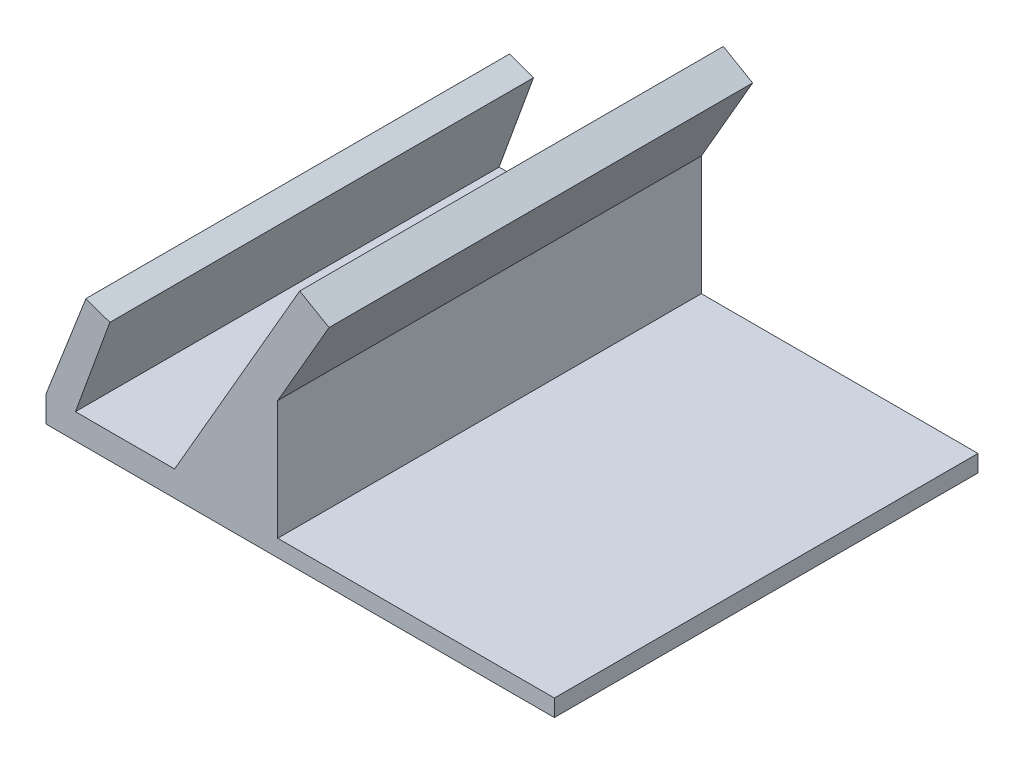
ISO-10303-21;
HEADER;
FILE_DESCRIPTION(('STEP AP214'),'2;1');
FILE_NAME('part.step','',(''),(''),'','','');
FILE_SCHEMA(('AUTOMOTIVE_DESIGN { 1 0 10303 214 1 1 1 1 }'));
ENDSEC;
DATA;
#1=APPLICATION_CONTEXT('core data for automotive mechanical design processes');
#2=APPLICATION_PROTOCOL_DEFINITION('international standard','automotive_design',2000,#1);
#3=PRODUCT_CONTEXT('',#1,'mechanical');
#4=PRODUCT('Part','Part','',(#3));
#5=PRODUCT_RELATED_PRODUCT_CATEGORY('part','',(#4));
#6=PRODUCT_DEFINITION_FORMATION('','',#4);
#7=PRODUCT_DEFINITION_CONTEXT('part definition',#1,'design');
#8=PRODUCT_DEFINITION('design','',#6,#7);
#9=PRODUCT_DEFINITION_SHAPE('','',#8);
#10=(LENGTH_UNIT() NAMED_UNIT(*) SI_UNIT(.MILLI.,.METRE.));
#11=(NAMED_UNIT(*) PLANE_ANGLE_UNIT() SI_UNIT($,.RADIAN.));
#12=(NAMED_UNIT(*) SI_UNIT($,.STERADIAN.) SOLID_ANGLE_UNIT());
#13=UNCERTAINTY_MEASURE_WITH_UNIT(LENGTH_MEASURE(1.E-05),#10,'distance_accuracy_value','');
#14=(GEOMETRIC_REPRESENTATION_CONTEXT(3) GLOBAL_UNCERTAINTY_ASSIGNED_CONTEXT((#13)) GLOBAL_UNIT_ASSIGNED_CONTEXT((#10,
#11,#12)) REPRESENTATION_CONTEXT('',''));
#15=CARTESIAN_POINT('',(0.,0.,0.));
#16=DIRECTION('',(0.,0.,1.));
#17=DIRECTION('',(1.,0.,0.));
#18=AXIS2_PLACEMENT_3D('',#15,#16,#17);
#19=CARTESIAN_POINT('',(-84.4925339039773,-6.99938021269525,50.));
#20=DIRECTION('',(0.,1.,0.));
#21=DIRECTION('',(0.,0.,1.));
#22=AXIS2_PLACEMENT_3D('',#19,#20,#21);
#23=PLANE('',#22);
#24=DIRECTION('',(1.,0.,0.));
#25=VECTOR('',#24,1.);
#26=CARTESIAN_POINT('',(-84.4925339039773,-6.99938021269525,0.));
#27=LINE('',#26,#25);
#28=CARTESIAN_POINT('',(-84.4925339039773,-6.99938021269525,0.));
#29=VERTEX_POINT('',#28);
#30=CARTESIAN_POINT('',(-24.4925339039772,-6.99938021269525,0.));
#31=VERTEX_POINT('',#30);
#32=EDGE_CURVE('E146',#29,#31,#27,.T.);
#33=ORIENTED_EDGE('',*,*,#32,.T.);
#34=DIRECTION('',(0.,0.,-1.));
#35=VECTOR('',#34,1.);
#36=CARTESIAN_POINT('',(-24.4925339039772,-6.99938021269525,50.));
#37=LINE('',#36,#35);
#38=CARTESIAN_POINT('',(-24.4925339039772,-6.99938021269525,50.));
#39=VERTEX_POINT('',#38);
#40=EDGE_CURVE('E228',#39,#31,#37,.T.);
#41=ORIENTED_EDGE('',*,*,#40,.F.);
#42=DIRECTION('',(1.,0.,0.));
#43=VECTOR('',#42,1.);
#44=CARTESIAN_POINT('',(-84.4925339039773,-6.99938021269525,50.));
#45=LINE('',#44,#43);
#46=CARTESIAN_POINT('',(-84.4925339039773,-6.99938021269525,50.));
#47=VERTEX_POINT('',#46);
#48=EDGE_CURVE('E98',#47,#39,#45,.T.);
#49=ORIENTED_EDGE('',*,*,#48,.F.);
#50=DIRECTION('',(0.,0.,-1.));
#51=VECTOR('',#50,1.);
#52=CARTESIAN_POINT('',(-84.4925339039773,-6.99938021269525,50.));
#53=LINE('',#52,#51);
#54=EDGE_CURVE('E11',#47,#29,#53,.T.);
#55=ORIENTED_EDGE('',*,*,#54,.T.);
#56=EDGE_LOOP('',(#33,#41,#49,#55));
#57=FACE_BOUND('',#56,.T.);
#58=ADVANCED_FACE('F33',(#57),#23,.F.);
#59=CARTESIAN_POINT('',(-45.4925339039751,-4.99938021269525,50.));
#60=DIRECTION('',(0.,-1.,0.));
#61=DIRECTION('',(1.,0.,0.));
#62=AXIS2_PLACEMENT_3D('',#59,#60,#61);
#63=PLANE('',#62);
#64=DIRECTION('',(-1.,0.,0.));
#65=VECTOR('',#64,1.);
#66=CARTESIAN_POINT('',(-45.4925339039751,-4.99938021269525,0.));
#67=LINE('',#66,#65);
#68=CARTESIAN_POINT('',(-24.4925339039772,-4.99938021269525,0.));
#69=VERTEX_POINT('',#68);
#70=CARTESIAN_POINT('',(-57.1473766382508,-4.99938021269525,0.));
#71=VERTEX_POINT('',#70);
#72=EDGE_CURVE('E149',#69,#71,#67,.T.);
#73=ORIENTED_EDGE('',*,*,#72,.T.);
#74=DIRECTION('',(0.,0.,-1.));
#75=VECTOR('',#74,1.);
#76=CARTESIAN_POINT('',(-57.1473766382508,-4.99938021269525,50.));
#77=LINE('',#76,#75);
#78=CARTESIAN_POINT('',(-57.1473766382508,-4.99938021269525,50.));
#79=VERTEX_POINT('',#78);
#80=EDGE_CURVE('E41',#79,#71,#77,.T.);
#81=ORIENTED_EDGE('',*,*,#80,.F.);
#82=DIRECTION('',(-1.,0.,0.));
#83=VECTOR('',#82,1.);
#84=CARTESIAN_POINT('',(-44.4925339039772,-4.99938021269525,50.));
#85=LINE('',#84,#83);
#86=CARTESIAN_POINT('',(-24.4925339039772,-4.99938021269525,50.));
#87=VERTEX_POINT('',#86);
#88=EDGE_CURVE('E220',#87,#79,#85,.T.);
#89=ORIENTED_EDGE('',*,*,#88,.F.);
#90=DIRECTION('',(0.,0.,1.));
#91=VECTOR('',#90,1.);
#92=CARTESIAN_POINT('',(-24.4925339039772,-4.99938021269525,50.));
#93=LINE('',#92,#91);
#94=EDGE_CURVE('E150',#69,#87,#93,.T.);
#95=ORIENTED_EDGE('',*,*,#94,.F.);
#96=EDGE_LOOP('',(#73,#81,#89,#95));
#97=FACE_BOUND('',#96,.T.);
#98=ADVANCED_FACE('F242',(#97),#63,.F.);
#99=CARTESIAN_POINT('',(-57.1473766382508,-4.99938021269525,50.));
#100=DIRECTION('',(-1.,0.,0.));
#101=DIRECTION('',(0.,-1.,0.));
#102=AXIS2_PLACEMENT_3D('',#99,#100,#101);
#103=PLANE('',#102);
#104=DIRECTION('',(0.,1.,0.));
#105=VECTOR('',#104,1.);
#106=CARTESIAN_POINT('',(-57.1473766382508,-4.99938021269525,0.));
#107=LINE('',#106,#105);
#108=CARTESIAN_POINT('',(-57.1473766382508,9.0724224478723,0.));
#109=VERTEX_POINT('',#108);
#110=EDGE_CURVE('E152',#71,#109,#107,.T.);
#111=ORIENTED_EDGE('',*,*,#110,.T.);
#112=DIRECTION('',(0.,0.,-1.));
#113=VECTOR('',#112,1.);
#114=CARTESIAN_POINT('',(-57.1473766382508,9.0724224478723,50.));
#115=LINE('',#114,#113);
#116=CARTESIAN_POINT('',(-57.1473766382508,9.0724224478723,50.));
#117=VERTEX_POINT('',#116);
#118=EDGE_CURVE('E183',#117,#109,#115,.T.);
#119=ORIENTED_EDGE('',*,*,#118,.F.);
#120=DIRECTION('',(0.,1.,0.));
#121=VECTOR('',#120,1.);
#122=CARTESIAN_POINT('',(-57.1473766382508,-4.99938021269525,50.));
#123=LINE('',#122,#121);
#124=EDGE_CURVE('E192',#79,#117,#123,.T.);
#125=ORIENTED_EDGE('',*,*,#124,.F.);
#126=ORIENTED_EDGE('',*,*,#80,.T.);
#127=EDGE_LOOP('',(#111,#119,#125,#126));
#128=FACE_BOUND('',#127,.T.);
#129=ADVANCED_FACE('F190',(#128),#103,.F.);
#130=CARTESIAN_POINT('',(-51.5857610761588,18.7054231735816,50.));
#131=DIRECTION('',(-0.866025403784443,0.499999999999992,0.));
#132=DIRECTION('',(-0.499999999999992,-0.866025403784443,0.));
#133=AXIS2_PLACEMENT_3D('',#130,#131,#132);
#134=PLANE('',#133);
#135=DIRECTION('',(0.499999999999992,0.866025403784443,0.));
#136=VECTOR('',#135,1.);
#137=CARTESIAN_POINT('',(-51.5857610761588,18.7054231735816,0.));
#138=LINE('',#137,#136);
#139=CARTESIAN_POINT('',(-51.0857610761588,19.571448577366,0.));
#140=VERTEX_POINT('',#139);
#141=EDGE_CURVE('E155',#109,#140,#138,.T.);
#142=ORIENTED_EDGE('',*,*,#141,.T.);
#143=DIRECTION('',(0.,0.,-1.));
#144=VECTOR('',#143,1.);
#145=CARTESIAN_POINT('',(-51.0857610761588,19.571448577366,50.));
#146=LINE('',#145,#144);
#147=CARTESIAN_POINT('',(-51.0857610761588,19.571448577366,50.));
#148=VERTEX_POINT('',#147);
#149=EDGE_CURVE('E180',#148,#140,#146,.T.);
#150=ORIENTED_EDGE('',*,*,#149,.F.);
#151=DIRECTION('',(0.499999999999995,0.866025403784442,0.));
#152=VECTOR('',#151,1.);
#153=CARTESIAN_POINT('',(-57.1473766382508,9.0724224478723,50.));
#154=LINE('',#153,#152);
#155=EDGE_CURVE('E214',#117,#148,#154,.T.);
#156=ORIENTED_EDGE('',*,*,#155,.F.);
#157=ORIENTED_EDGE('',*,*,#118,.T.);
#158=EDGE_LOOP('',(#142,#150,#156,#157));
#159=FACE_BOUND('',#158,.T.);
#160=ADVANCED_FACE('F205',(#159),#134,.F.);
#161=CARTESIAN_POINT('',(-51.0857610761588,19.571448577366,50.));
#162=DIRECTION('',(-0.499999999999997,-0.86602540378444,0.));
#163=DIRECTION('',(0.86602540378444,-0.499999999999997,0.));
#164=AXIS2_PLACEMENT_3D('',#161,#162,#163);
#165=PLANE('',#164);
#166=DIRECTION('',(-0.86602540378444,0.499999999999997,0.));
#167=VECTOR('',#166,1.);
#168=CARTESIAN_POINT('',(-51.0857610761588,19.571448577366,0.));
#169=LINE('',#168,#167);
#170=CARTESIAN_POINT('',(-54.5498626912966,21.571448577366,0.));
#171=VERTEX_POINT('',#170);
#172=EDGE_CURVE('E157',#140,#171,#169,.T.);
#173=ORIENTED_EDGE('',*,*,#172,.T.);
#174=DIRECTION('',(0.,0.,-1.));
#175=VECTOR('',#174,1.);
#176=CARTESIAN_POINT('',(-54.5498626912966,21.571448577366,50.));
#177=LINE('',#176,#175);
#178=CARTESIAN_POINT('',(-54.5498626912966,21.571448577366,50.));
#179=VERTEX_POINT('',#178);
#180=EDGE_CURVE('E177',#179,#171,#177,.T.);
#181=ORIENTED_EDGE('',*,*,#180,.F.);
#182=DIRECTION('',(-0.86602540378444,0.499999999999997,0.));
#183=VECTOR('',#182,1.);
#184=CARTESIAN_POINT('',(-51.0857610761588,19.571448577366,50.));
#185=LINE('',#184,#183);
#186=EDGE_CURVE('E211',#148,#179,#185,.T.);
#187=ORIENTED_EDGE('',*,*,#186,.F.);
#188=ORIENTED_EDGE('',*,*,#149,.T.);
#189=EDGE_LOOP('',(#173,#181,#187,#188));
#190=FACE_BOUND('',#189,.T.);
#191=ADVANCED_FACE('F209',(#190),#165,.F.);
#192=CARTESIAN_POINT('',(-54.5498626912966,21.571448577366,50.));
#193=DIRECTION('',(0.866025403784442,-0.499999999999994,0.));
#194=DIRECTION('',(0.499999999999994,0.866025403784442,0.));
#195=AXIS2_PLACEMENT_3D('',#192,#193,#194);
#196=PLANE('',#195);
#197=DIRECTION('',(-0.499999999999994,-0.866025403784442,0.));
#198=VECTOR('',#197,1.);
#199=CARTESIAN_POINT('',(-54.5498626912966,21.571448577366,0.));
#200=LINE('',#199,#198);
#201=CARTESIAN_POINT('',(-69.31318757664,-3.99938021269525,0.));
#202=VERTEX_POINT('',#201);
#203=EDGE_CURVE('E159',#171,#202,#200,.T.);
#204=ORIENTED_EDGE('',*,*,#203,.T.);
#205=DIRECTION('',(0.,0.,-1.));
#206=VECTOR('',#205,1.);
#207=CARTESIAN_POINT('',(-69.31318757664,-3.99938021269525,50.));
#208=LINE('',#207,#206);
#209=CARTESIAN_POINT('',(-69.31318757664,-3.99938021269525,50.));
#210=VERTEX_POINT('',#209);
#211=EDGE_CURVE('E174',#210,#202,#208,.T.);
#212=ORIENTED_EDGE('',*,*,#211,.F.);
#213=DIRECTION('',(-0.499999999999994,-0.866025403784442,0.));
#214=VECTOR('',#213,1.);
#215=CARTESIAN_POINT('',(-54.5498626912966,21.571448577366,50.));
#216=LINE('',#215,#214);
#217=EDGE_CURVE('E213',#179,#210,#216,.T.);
#218=ORIENTED_EDGE('',*,*,#217,.F.);
#219=ORIENTED_EDGE('',*,*,#180,.T.);
#220=EDGE_LOOP('',(#204,#212,#218,#219));
#221=FACE_BOUND('',#220,.T.);
#222=ADVANCED_FACE('F255',(#221),#196,.F.);
#223=CARTESIAN_POINT('',(-69.31318757664,-3.99938021269525,50.));
#224=DIRECTION('',(0.,-1.,0.));
#225=DIRECTION('',(1.,0.,0.));
#226=AXIS2_PLACEMENT_3D('',#223,#224,#225);
#227=PLANE('',#226);
#228=DIRECTION('',(-1.,0.,0.));
#229=VECTOR('',#228,1.);
#230=CARTESIAN_POINT('',(-69.31318757664,-3.99938021269525,0.));
#231=LINE('',#230,#229);
#232=CARTESIAN_POINT('',(-81.0191430738751,-3.99938021269525,0.));
#233=VERTEX_POINT('',#232);
#234=EDGE_CURVE('E161',#202,#233,#231,.T.);
#235=ORIENTED_EDGE('',*,*,#234,.T.);
#236=DIRECTION('',(0.,0.,-1.));
#237=VECTOR('',#236,1.);
#238=CARTESIAN_POINT('',(-81.0191430738751,-3.99938021269525,50.));
#239=LINE('',#238,#237);
#240=CARTESIAN_POINT('',(-81.0191430738751,-3.99938021269525,50.));
#241=VERTEX_POINT('',#240);
#242=EDGE_CURVE('E137',#241,#233,#239,.T.);
#243=ORIENTED_EDGE('',*,*,#242,.F.);
#244=DIRECTION('',(-1.,0.,0.));
#245=VECTOR('',#244,1.);
#246=CARTESIAN_POINT('',(-69.31318757664,-3.99938021269525,50.));
#247=LINE('',#246,#245);
#248=EDGE_CURVE('E127',#210,#241,#247,.T.);
#249=ORIENTED_EDGE('',*,*,#248,.F.);
#250=ORIENTED_EDGE('',*,*,#211,.T.);
#251=EDGE_LOOP('',(#235,#243,#249,#250));
#252=FACE_BOUND('',#251,.T.);
#253=ADVANCED_FACE('F258',(#252),#227,.F.);
#254=CARTESIAN_POINT('',(-77.2973716615208,6.22610270311998,50.));
#255=DIRECTION('',(-0.939692620785908,0.342020143325669,0.));
#256=DIRECTION('',(-0.342020143325669,-0.939692620785909,0.));
#257=AXIS2_PLACEMENT_3D('',#254,#255,#256);
#258=PLANE('',#257);
#259=DIRECTION('',(0.342020143325669,0.939692620785908,0.));
#260=VECTOR('',#259,1.);
#261=CARTESIAN_POINT('',(-77.2973716615208,6.22610270311998,0.));
#262=LINE('',#261,#260);
#263=CARTESIAN_POINT('',(-76.9553515181951,7.16579532390589,0.));
#264=VERTEX_POINT('',#263);
#265=EDGE_CURVE('E135',#233,#264,#262,.T.);
#266=ORIENTED_EDGE('',*,*,#265,.T.);
#267=DIRECTION('',(0.,0.,-1.));
#268=VECTOR('',#267,1.);
#269=CARTESIAN_POINT('',(-76.9553515181951,7.16579532390589,50.));
#270=LINE('',#269,#268);
#271=CARTESIAN_POINT('',(-76.9553515181951,7.16579532390589,50.));
#272=VERTEX_POINT('',#271);
#273=EDGE_CURVE('E133',#272,#264,#270,.T.);
#274=ORIENTED_EDGE('',*,*,#273,.F.);
#275=DIRECTION('',(0.34202014332567,0.939692620785908,0.));
#276=VECTOR('',#275,1.);
#277=CARTESIAN_POINT('',(-80.5306876879189,-2.65736006936958,50.));
#278=LINE('',#277,#276);
#279=EDGE_CURVE('E120',#241,#272,#278,.T.);
#280=ORIENTED_EDGE('',*,*,#279,.F.);
#281=ORIENTED_EDGE('',*,*,#242,.T.);
#282=EDGE_LOOP('',(#266,#274,#280,#281));
#283=FACE_BOUND('',#282,.T.);
#284=ADVANCED_FACE('F134',(#283),#258,.F.);
#285=CARTESIAN_POINT('',(-76.9553515181951,7.16579532390589,50.));
#286=DIRECTION('',(-0.34202014332567,-0.939692620785908,0.));
#287=DIRECTION('',(0.939692620785908,-0.34202014332567,0.));
#288=AXIS2_PLACEMENT_3D('',#285,#286,#287);
#289=PLANE('',#288);
#290=DIRECTION('',(-0.939692620785908,0.34202014332567,0.));
#291=VECTOR('',#290,1.);
#292=CARTESIAN_POINT('',(-76.9553515181951,7.16579532390589,0.));
#293=LINE('',#292,#291);
#294=CARTESIAN_POINT('',(-79.7744293805528,8.1918557538829,0.));
#295=VERTEX_POINT('',#294);
#296=EDGE_CURVE('E165',#264,#295,#293,.T.);
#297=ORIENTED_EDGE('',*,*,#296,.T.);
#298=DIRECTION('',(0.,0.,-1.));
#299=VECTOR('',#298,1.);
#300=CARTESIAN_POINT('',(-79.7744293805528,8.1918557538829,50.));
#301=LINE('',#300,#299);
#302=CARTESIAN_POINT('',(-79.7744293805528,8.1918557538829,50.));
#303=VERTEX_POINT('',#302);
#304=EDGE_CURVE('E138',#303,#295,#301,.T.);
#305=ORIENTED_EDGE('',*,*,#304,.F.);
#306=DIRECTION('',(-0.939692620785908,0.34202014332567,0.));
#307=VECTOR('',#306,1.);
#308=CARTESIAN_POINT('',(-76.9553515181951,7.16579532390589,50.));
#309=LINE('',#308,#307);
#310=EDGE_CURVE('E124',#272,#303,#309,.T.);
#311=ORIENTED_EDGE('',*,*,#310,.F.);
#312=ORIENTED_EDGE('',*,*,#273,.T.);
#313=EDGE_LOOP('',(#297,#305,#311,#312));
#314=FACE_BOUND('',#313,.T.);
#315=ADVANCED_FACE('F140',(#314),#289,.F.);
#316=CARTESIAN_POINT('',(-84.4925339039773,-3.92175187167777,50.));
#317=DIRECTION('',(0.931815971196975,-0.362931117186496,0.));
#318=DIRECTION('',(0.362931117186496,0.931815971196975,0.));
#319=AXIS2_PLACEMENT_3D('',#316,#317,#318);
#320=PLANE('',#319);
#321=DIRECTION('',(-0.362931117186496,-0.931815971196975,0.));
#322=VECTOR('',#321,1.);
#323=CARTESIAN_POINT('',(-84.4925339039773,-3.92175187167777,0.));
#324=LINE('',#323,#322);
#325=CARTESIAN_POINT('',(-84.4925339039773,-3.92175187167777,0.));
#326=VERTEX_POINT('',#325);
#327=EDGE_CURVE('E85',#295,#326,#324,.T.);
#328=ORIENTED_EDGE('',*,*,#327,.T.);
#329=DIRECTION('',(0.,0.,-1.));
#330=VECTOR('',#329,1.);
#331=CARTESIAN_POINT('',(-84.4925339039773,-3.92175187167777,50.));
#332=LINE('',#331,#330);
#333=CARTESIAN_POINT('',(-84.4925339039773,-3.92175187167777,50.));
#334=VERTEX_POINT('',#333);
#335=EDGE_CURVE('E142',#334,#326,#332,.T.);
#336=ORIENTED_EDGE('',*,*,#335,.F.);
#337=DIRECTION('',(-0.362931117186487,-0.931815971196979,0.));
#338=VECTOR('',#337,1.);
#339=CARTESIAN_POINT('',(-79.7744293805528,8.1918557538829,50.));
#340=LINE('',#339,#338);
#341=EDGE_CURVE('E49',#303,#334,#340,.T.);
#342=ORIENTED_EDGE('',*,*,#341,.F.);
#343=ORIENTED_EDGE('',*,*,#304,.T.);
#344=EDGE_LOOP('',(#328,#336,#342,#343));
#345=FACE_BOUND('',#344,.T.);
#346=ADVANCED_FACE('F267',(#345),#320,.F.);
#347=CARTESIAN_POINT('',(-84.4925339039773,-4.10962231202909,50.));
#348=DIRECTION('',(1.,0.,0.));
#349=DIRECTION('',(0.,1.,0.));
#350=AXIS2_PLACEMENT_3D('',#347,#348,#349);
#351=PLANE('',#350);
#352=DIRECTION('',(0.,-1.,0.));
#353=VECTOR('',#352,1.);
#354=CARTESIAN_POINT('',(-84.4925339039773,-4.10962231202909,0.));
#355=LINE('',#354,#353);
#356=EDGE_CURVE('E168',#326,#29,#355,.T.);
#357=ORIENTED_EDGE('',*,*,#356,.T.);
#358=ORIENTED_EDGE('',*,*,#54,.F.);
#359=DIRECTION('',(0.,-1.,0.));
#360=VECTOR('',#359,1.);
#361=CARTESIAN_POINT('',(-84.4925339039773,-6.99938021269525,50.));
#362=LINE('',#361,#360);
#363=EDGE_CURVE('E170',#334,#47,#362,.T.);
#364=ORIENTED_EDGE('',*,*,#363,.F.);
#365=ORIENTED_EDGE('',*,*,#335,.T.);
#366=EDGE_LOOP('',(#357,#358,#364,#365));
#367=FACE_BOUND('',#366,.T.);
#368=ADVANCED_FACE('F270',(#367),#351,.F.);
#369=CARTESIAN_POINT('',(0.,0.,50.));
#370=DIRECTION('',(0.,0.,1.));
#371=DIRECTION('',(1.,0.,0.));
#372=AXIS2_PLACEMENT_3D('',#369,#370,#371);
#373=PLANE('',#372);
#374=ORIENTED_EDGE('',*,*,#363,.T.);
#375=ORIENTED_EDGE('',*,*,#48,.T.);
#376=DIRECTION('',(0.,-1.,0.));
#377=VECTOR('',#376,1.);
#378=CARTESIAN_POINT('',(-24.4925339039772,-4.99938021269525,50.));
#379=LINE('',#378,#377);
#380=EDGE_CURVE('E231',#87,#39,#379,.T.);
#381=ORIENTED_EDGE('',*,*,#380,.F.);
#382=ORIENTED_EDGE('',*,*,#88,.T.);
#383=ORIENTED_EDGE('',*,*,#124,.T.);
#384=ORIENTED_EDGE('',*,*,#155,.T.);
#385=ORIENTED_EDGE('',*,*,#186,.T.);
#386=ORIENTED_EDGE('',*,*,#217,.T.);
#387=ORIENTED_EDGE('',*,*,#248,.T.);
#388=ORIENTED_EDGE('',*,*,#279,.T.);
#389=ORIENTED_EDGE('',*,*,#310,.T.);
#390=ORIENTED_EDGE('',*,*,#341,.T.);
#391=EDGE_LOOP('',(#374,#375,#381,#382,#383,#384,#385,#386,#387,#388,#389,#390));
#392=FACE_BOUND('',#391,.T.);
#393=ADVANCED_FACE('F122',(#392),#373,.T.);
#394=CARTESIAN_POINT('',(0.,0.,0.));
#395=DIRECTION('',(0.,0.,1.));
#396=DIRECTION('',(1.,0.,0.));
#397=AXIS2_PLACEMENT_3D('',#394,#395,#396);
#398=PLANE('',#397);
#399=ORIENTED_EDGE('',*,*,#32,.F.);
#400=ORIENTED_EDGE('',*,*,#356,.F.);
#401=ORIENTED_EDGE('',*,*,#327,.F.);
#402=ORIENTED_EDGE('',*,*,#296,.F.);
#403=ORIENTED_EDGE('',*,*,#265,.F.);
#404=ORIENTED_EDGE('',*,*,#234,.F.);
#405=ORIENTED_EDGE('',*,*,#203,.F.);
#406=ORIENTED_EDGE('',*,*,#172,.F.);
#407=ORIENTED_EDGE('',*,*,#141,.F.);
#408=ORIENTED_EDGE('',*,*,#110,.F.);
#409=ORIENTED_EDGE('',*,*,#72,.F.);
#410=DIRECTION('',(0.,1.,0.));
#411=VECTOR('',#410,1.);
#412=CARTESIAN_POINT('',(-24.4925339039772,-4.99938021269525,0.));
#413=LINE('',#412,#411);
#414=EDGE_CURVE('E226',#31,#69,#413,.T.);
#415=ORIENTED_EDGE('',*,*,#414,.F.);
#416=EDGE_LOOP('',(#399,#400,#401,#402,#403,#404,#405,#406,#407,#408,#409,#415));
#417=FACE_BOUND('',#416,.T.);
#418=ADVANCED_FACE('F197',(#417),#398,.F.);
#419=CARTESIAN_POINT('',(-24.4925339039772,0.,0.));
#420=DIRECTION('',(1.,0.,0.));
#421=DIRECTION('',(0.,0.,-1.));
#422=AXIS2_PLACEMENT_3D('',#419,#420,#421);
#423=PLANE('',#422);
#424=ORIENTED_EDGE('',*,*,#380,.T.);
#425=ORIENTED_EDGE('',*,*,#40,.T.);
#426=ORIENTED_EDGE('',*,*,#414,.T.);
#427=ORIENTED_EDGE('',*,*,#94,.T.);
#428=EDGE_LOOP('',(#424,#425,#426,#427));
#429=FACE_BOUND('',#428,.T.);
#430=ADVANCED_FACE('F236',(#429),#423,.T.);
#431=CLOSED_SHELL('',(#58,#98,#129,#160,#191,#222,#253,#284,#315,#346,#368,#393,#418,#430));
#432=MANIFOLD_SOLID_BREP('B2',#431);
#433=ADVANCED_BREP_SHAPE_REPRESENTATION('',(#18,#432),#14);
#434=SHAPE_DEFINITION_REPRESENTATION(#9,#433);
ENDSEC;
END-ISO-10303-21;
